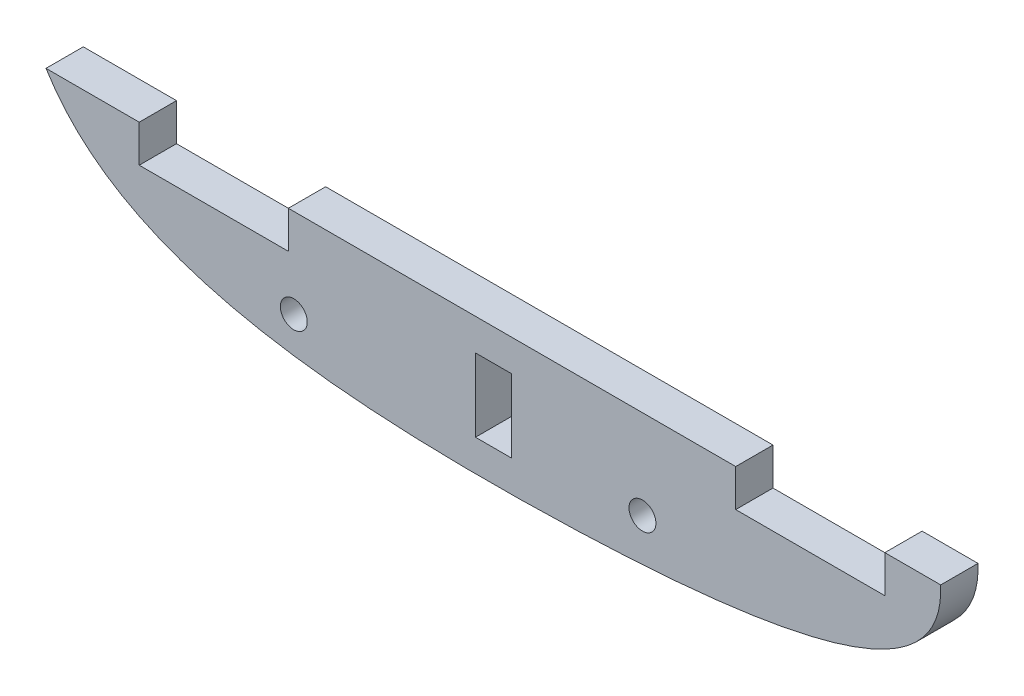
ISO-10303-21;
HEADER;
FILE_DESCRIPTION(('STEP AP214'),'2;1');
FILE_NAME('part.step','',(''),(''),'','','');
FILE_SCHEMA(('AUTOMOTIVE_DESIGN { 1 0 10303 214 1 1 1 1 }'));
ENDSEC;
DATA;
#1=APPLICATION_CONTEXT('core data for automotive mechanical design processes');
#2=APPLICATION_PROTOCOL_DEFINITION('international standard','automotive_design',2000,#1);
#3=PRODUCT_CONTEXT('',#1,'mechanical');
#4=PRODUCT('Part','Part','',(#3));
#5=PRODUCT_RELATED_PRODUCT_CATEGORY('part','',(#4));
#6=PRODUCT_DEFINITION_FORMATION('','',#4);
#7=PRODUCT_DEFINITION_CONTEXT('part definition',#1,'design');
#8=PRODUCT_DEFINITION('design','',#6,#7);
#9=PRODUCT_DEFINITION_SHAPE('','',#8);
#10=(LENGTH_UNIT() NAMED_UNIT(*) SI_UNIT(.MILLI.,.METRE.));
#11=(NAMED_UNIT(*) PLANE_ANGLE_UNIT() SI_UNIT($,.RADIAN.));
#12=(NAMED_UNIT(*) SI_UNIT($,.STERADIAN.) SOLID_ANGLE_UNIT());
#13=UNCERTAINTY_MEASURE_WITH_UNIT(LENGTH_MEASURE(1.E-05),#10,'distance_accuracy_value','');
#14=(GEOMETRIC_REPRESENTATION_CONTEXT(3) GLOBAL_UNCERTAINTY_ASSIGNED_CONTEXT((#13)) GLOBAL_UNIT_ASSIGNED_CONTEXT((#10,
#11,#12)) REPRESENTATION_CONTEXT('',''));
#15=CARTESIAN_POINT('',(0.,0.,0.));
#16=DIRECTION('',(0.,0.,1.));
#17=DIRECTION('',(1.,0.,0.));
#18=AXIS2_PLACEMENT_3D('',#15,#16,#17);
#19=CARTESIAN_POINT('',(102.303881757425,0.874047531603032,6.35));
#20=DIRECTION('',(0.,0.,-1.));
#21=DIRECTION('',(-1.,0.,0.));
#22=AXIS2_PLACEMENT_3D('',#19,#20,#21);
#23=PLANE('',#22);
#24=CARTESIAN_POINT('',(42.2078086542806,8.06779514585758,6.35));
#25=DIRECTION('',(0.,0.,1.));
#26=DIRECTION('',(1.,0.,0.));
#27=AXIS2_PLACEMENT_3D('',#24,#25,#26);
#28=CIRCLE('',#27,2.29235);
#29=CARTESIAN_POINT('',(44.5001586542806,8.06779514585758,6.35));
#30=VERTEX_POINT('',#29);
#31=EDGE_CURVE('E173',#30,#30,#28,.T.);
#32=ORIENTED_EDGE('',*,*,#31,.F.);
#33=EDGE_LOOP('',(#32));
#34=FACE_BOUND('',#33,.T.);
#35=CARTESIAN_POINT('',(101.6,8.06779514585758,6.35));
#36=DIRECTION('',(0.,0.,1.));
#37=DIRECTION('',(1.,0.,0.));
#38=AXIS2_PLACEMENT_3D('',#35,#36,#37);
#39=CIRCLE('',#38,2.29235);
#40=CARTESIAN_POINT('',(103.89235,8.06779514585758,6.35));
#41=VERTEX_POINT('',#40);
#42=EDGE_CURVE('E179',#41,#41,#39,.T.);
#43=ORIENTED_EDGE('',*,*,#42,.F.);
#44=EDGE_LOOP('',(#43));
#45=FACE_BOUND('',#44,.T.);
#46=CARTESIAN_POINT('',(0.,23.242297620253,6.35));
#47=CARTESIAN_POINT('',(9.59572841342026,7.57167225706401,6.35));
#48=CARTESIAN_POINT('',(37.6916295468297,-0.623304840125745,6.35));
#49=CARTESIAN_POINT('',(137.924513906563,0.735082948256874,6.35));
#50=CARTESIAN_POINT('',(152.821327452565,10.8513459079273,6.35));
#51=CARTESIAN_POINT('',(152.4,23.242297620253,6.35));
#52=B_SPLINE_CURVE_WITH_KNOTS('',3,(#46,#47,#48,#49,#50,#51),.UNSPECIFIED.,.F.,.F.,(4,1,1,4),
(0.,0.362368997346924,0.462368997346923,1.),.UNSPECIFIED.);
#53=CARTESIAN_POINT('',(0.,23.242297620253,6.35));
#54=VERTEX_POINT('',#53);
#55=CARTESIAN_POINT('',(152.4,23.242297620253,6.35));
#56=VERTEX_POINT('',#55);
#57=EDGE_CURVE('E184',#54,#56,#52,.T.);
#58=ORIENTED_EDGE('',*,*,#57,.T.);
#59=DIRECTION('',(-1.,0.,0.));
#60=VECTOR('',#59,1.);
#61=CARTESIAN_POINT('',(142.880645326395,23.242297620253,6.35));
#62=LINE('',#61,#60);
#63=CARTESIAN_POINT('',(142.880645326395,23.242297620253,6.35));
#64=VERTEX_POINT('',#63);
#65=EDGE_CURVE('E190',#56,#64,#62,.T.);
#66=ORIENTED_EDGE('',*,*,#65,.T.);
#67=DIRECTION('',(0.,-1.,0.));
#68=VECTOR('',#67,1.);
#69=CARTESIAN_POINT('',(142.880645326395,23.242297620253,6.35));
#70=LINE('',#69,#68);
#71=CARTESIAN_POINT('',(142.880645326395,16.892297620253,6.35));
#72=VERTEX_POINT('',#71);
#73=EDGE_CURVE('E196',#64,#72,#70,.T.);
#74=ORIENTED_EDGE('',*,*,#73,.T.);
#75=DIRECTION('',(-1.,0.,0.));
#76=VECTOR('',#75,1.);
#77=CARTESIAN_POINT('',(117.480645326395,16.892297620253,6.35));
#78=LINE('',#77,#76);
#79=CARTESIAN_POINT('',(117.480645326395,16.892297620253,6.35));
#80=VERTEX_POINT('',#79);
#81=EDGE_CURVE('E198',#72,#80,#78,.T.);
#82=ORIENTED_EDGE('',*,*,#81,.T.);
#83=DIRECTION('',(0.,1.,0.));
#84=VECTOR('',#83,1.);
#85=CARTESIAN_POINT('',(117.480645326395,23.242297620253,6.35));
#86=LINE('',#85,#84);
#87=CARTESIAN_POINT('',(117.480645326395,23.242297620253,6.35));
#88=VERTEX_POINT('',#87);
#89=EDGE_CURVE('E200',#80,#88,#86,.T.);
#90=ORIENTED_EDGE('',*,*,#89,.T.);
#91=DIRECTION('',(-1.,0.,0.));
#92=VECTOR('',#91,1.);
#93=CARTESIAN_POINT('',(41.2806453263953,23.242297620253,6.35));
#94=LINE('',#93,#92);
#95=CARTESIAN_POINT('',(41.2806453263953,23.242297620253,6.35));
#96=VERTEX_POINT('',#95);
#97=EDGE_CURVE('E202',#88,#96,#94,.T.);
#98=ORIENTED_EDGE('',*,*,#97,.T.);
#99=DIRECTION('',(0.,-1.,0.));
#100=VECTOR('',#99,1.);
#101=CARTESIAN_POINT('',(41.2806453263953,23.242297620253,6.35));
#102=LINE('',#101,#100);
#103=CARTESIAN_POINT('',(41.2806453263953,16.892297620253,6.35));
#104=VERTEX_POINT('',#103);
#105=EDGE_CURVE('E204',#96,#104,#102,.T.);
#106=ORIENTED_EDGE('',*,*,#105,.T.);
#107=DIRECTION('',(-1.,0.,0.));
#108=VECTOR('',#107,1.);
#109=CARTESIAN_POINT('',(15.8806453263953,16.892297620253,6.35));
#110=LINE('',#109,#108);
#111=CARTESIAN_POINT('',(15.8806453263953,16.892297620253,6.35));
#112=VERTEX_POINT('',#111);
#113=EDGE_CURVE('E206',#104,#112,#110,.T.);
#114=ORIENTED_EDGE('',*,*,#113,.T.);
#115=DIRECTION('',(0.,1.,0.));
#116=VECTOR('',#115,1.);
#117=CARTESIAN_POINT('',(15.8806453263953,23.242297620253,6.35));
#118=LINE('',#117,#116);
#119=CARTESIAN_POINT('',(15.8806453263953,23.242297620253,6.35));
#120=VERTEX_POINT('',#119);
#121=EDGE_CURVE('E208',#112,#120,#118,.T.);
#122=ORIENTED_EDGE('',*,*,#121,.T.);
#123=DIRECTION('',(-1.,0.,0.));
#124=VECTOR('',#123,1.);
#125=CARTESIAN_POINT('',(0.,23.242297620253,6.35));
#126=LINE('',#125,#124);
#127=EDGE_CURVE('E210',#120,#54,#126,.T.);
#128=ORIENTED_EDGE('',*,*,#127,.T.);
#129=EDGE_LOOP('',(#58,#66,#74,#82,#90,#98,#106,#114,#122,#128));
#130=FACE_BOUND('',#129,.T.);
#131=DIRECTION('',(0.,1.,0.));
#132=VECTOR('',#131,1.);
#133=CARTESIAN_POINT('',(79.248,5.39814881012649,6.35));
#134=LINE('',#133,#132);
#135=CARTESIAN_POINT('',(79.248,5.39814881012649,6.35));
#136=VERTEX_POINT('',#135);
#137=CARTESIAN_POINT('',(79.248,17.8441488101265,6.35));
#138=VERTEX_POINT('',#137);
#139=EDGE_CURVE('E137',#136,#138,#134,.T.);
#140=ORIENTED_EDGE('',*,*,#139,.F.);
#141=DIRECTION('',(1.,0.,0.));
#142=VECTOR('',#141,1.);
#143=CARTESIAN_POINT('',(73.152,5.39814881012649,6.35));
#144=LINE('',#143,#142);
#145=CARTESIAN_POINT('',(73.152,5.39814881012649,6.35));
#146=VERTEX_POINT('',#145);
#147=EDGE_CURVE('E159',#146,#136,#144,.T.);
#148=ORIENTED_EDGE('',*,*,#147,.F.);
#149=DIRECTION('',(0.,-1.,0.));
#150=VECTOR('',#149,1.);
#151=CARTESIAN_POINT('',(73.152,5.39814881012649,6.35));
#152=LINE('',#151,#150);
#153=CARTESIAN_POINT('',(73.152,17.8441488101265,6.35));
#154=VERTEX_POINT('',#153);
#155=EDGE_CURVE('E157',#154,#146,#152,.T.);
#156=ORIENTED_EDGE('',*,*,#155,.F.);
#157=DIRECTION('',(-1.,0.,0.));
#158=VECTOR('',#157,1.);
#159=CARTESIAN_POINT('',(73.152,17.8441488101265,6.35));
#160=LINE('',#159,#158);
#161=EDGE_CURVE('E145',#138,#154,#160,.T.);
#162=ORIENTED_EDGE('',*,*,#161,.F.);
#163=EDGE_LOOP('',(#140,#148,#156,#162));
#164=FACE_BOUND('',#163,.T.);
#165=ADVANCED_FACE('F35',(#34,#45,#130,#164),#23,.F.);
#166=CARTESIAN_POINT('',(102.303881757425,0.874047531603032,0.));
#167=DIRECTION('',(0.,0.,-1.));
#168=DIRECTION('',(-1.,0.,0.));
#169=AXIS2_PLACEMENT_3D('',#166,#167,#168);
#170=PLANE('',#169);
#171=CARTESIAN_POINT('',(101.6,8.06779514585758,0.));
#172=DIRECTION('',(0.,0.,1.));
#173=DIRECTION('',(1.,0.,0.));
#174=AXIS2_PLACEMENT_3D('',#171,#172,#173);
#175=CIRCLE('',#174,2.29235);
#176=CARTESIAN_POINT('',(103.89235,8.06779514585758,0.));
#177=VERTEX_POINT('',#176);
#178=EDGE_CURVE('E176',#177,#177,#175,.T.);
#179=ORIENTED_EDGE('',*,*,#178,.T.);
#180=EDGE_LOOP('',(#179));
#181=FACE_BOUND('',#180,.T.);
#182=CARTESIAN_POINT('',(0.,23.242297620253,0.));
#183=CARTESIAN_POINT('',(9.59572841342026,7.57167225706401,0.));
#184=CARTESIAN_POINT('',(37.6916295468297,-0.623304840125745,0.));
#185=CARTESIAN_POINT('',(137.924513906563,0.735082948256874,0.));
#186=CARTESIAN_POINT('',(152.821327452565,10.8513459079273,0.));
#187=CARTESIAN_POINT('',(152.4,23.242297620253,0.));
#188=B_SPLINE_CURVE_WITH_KNOTS('',3,(#182,#183,#184,#185,#186,#187),.UNSPECIFIED.,.F.,.F.,(4,1,
1,4),(0.,0.362368997346924,0.462368997346923,1.),.UNSPECIFIED.);
#189=CARTESIAN_POINT('',(0.,23.242297620253,0.));
#190=VERTEX_POINT('',#189);
#191=CARTESIAN_POINT('',(152.4,23.242297620253,0.));
#192=VERTEX_POINT('',#191);
#193=EDGE_CURVE('E182',#190,#192,#188,.T.);
#194=ORIENTED_EDGE('',*,*,#193,.F.);
#195=DIRECTION('',(-1.,0.,0.));
#196=VECTOR('',#195,1.);
#197=CARTESIAN_POINT('',(0.,23.242297620253,0.));
#198=LINE('',#197,#196);
#199=CARTESIAN_POINT('',(15.8806453263953,23.242297620253,0.));
#200=VERTEX_POINT('',#199);
#201=EDGE_CURVE('E191',#200,#190,#198,.T.);
#202=ORIENTED_EDGE('',*,*,#201,.F.);
#203=DIRECTION('',(0.,1.,0.));
#204=VECTOR('',#203,1.);
#205=CARTESIAN_POINT('',(15.8806453263953,23.242297620253,0.));
#206=LINE('',#205,#204);
#207=CARTESIAN_POINT('',(15.8806453263953,16.892297620253,0.));
#208=VERTEX_POINT('',#207);
#209=EDGE_CURVE('E234',#208,#200,#206,.T.);
#210=ORIENTED_EDGE('',*,*,#209,.F.);
#211=DIRECTION('',(-1.,0.,0.));
#212=VECTOR('',#211,1.);
#213=CARTESIAN_POINT('',(15.8806453263953,16.892297620253,0.));
#214=LINE('',#213,#212);
#215=CARTESIAN_POINT('',(41.2806453263953,16.892297620253,0.));
#216=VERTEX_POINT('',#215);
#217=EDGE_CURVE('E232',#216,#208,#214,.T.);
#218=ORIENTED_EDGE('',*,*,#217,.F.);
#219=DIRECTION('',(0.,-1.,0.));
#220=VECTOR('',#219,1.);
#221=CARTESIAN_POINT('',(41.2806453263953,23.242297620253,0.));
#222=LINE('',#221,#220);
#223=CARTESIAN_POINT('',(41.2806453263953,23.242297620253,0.));
#224=VERTEX_POINT('',#223);
#225=EDGE_CURVE('E230',#224,#216,#222,.T.);
#226=ORIENTED_EDGE('',*,*,#225,.F.);
#227=DIRECTION('',(-1.,0.,0.));
#228=VECTOR('',#227,1.);
#229=CARTESIAN_POINT('',(41.2806453263953,23.242297620253,0.));
#230=LINE('',#229,#228);
#231=CARTESIAN_POINT('',(117.480645326395,23.242297620253,0.));
#232=VERTEX_POINT('',#231);
#233=EDGE_CURVE('E228',#232,#224,#230,.T.);
#234=ORIENTED_EDGE('',*,*,#233,.F.);
#235=DIRECTION('',(0.,1.,0.));
#236=VECTOR('',#235,1.);
#237=CARTESIAN_POINT('',(117.480645326395,23.242297620253,0.));
#238=LINE('',#237,#236);
#239=CARTESIAN_POINT('',(117.480645326395,16.892297620253,0.));
#240=VERTEX_POINT('',#239);
#241=EDGE_CURVE('E226',#240,#232,#238,.T.);
#242=ORIENTED_EDGE('',*,*,#241,.F.);
#243=DIRECTION('',(-1.,0.,0.));
#244=VECTOR('',#243,1.);
#245=CARTESIAN_POINT('',(117.480645326395,16.892297620253,0.));
#246=LINE('',#245,#244);
#247=CARTESIAN_POINT('',(142.880645326395,16.892297620253,0.));
#248=VERTEX_POINT('',#247);
#249=EDGE_CURVE('E224',#248,#240,#246,.T.);
#250=ORIENTED_EDGE('',*,*,#249,.F.);
#251=DIRECTION('',(0.,-1.,0.));
#252=VECTOR('',#251,1.);
#253=CARTESIAN_POINT('',(142.880645326395,23.242297620253,0.));
#254=LINE('',#253,#252);
#255=CARTESIAN_POINT('',(142.880645326395,23.242297620253,0.));
#256=VERTEX_POINT('',#255);
#257=EDGE_CURVE('E222',#256,#248,#254,.T.);
#258=ORIENTED_EDGE('',*,*,#257,.F.);
#259=DIRECTION('',(-1.,0.,0.));
#260=VECTOR('',#259,1.);
#261=CARTESIAN_POINT('',(142.880645326395,23.242297620253,0.));
#262=LINE('',#261,#260);
#263=EDGE_CURVE('E217',#192,#256,#262,.T.);
#264=ORIENTED_EDGE('',*,*,#263,.F.);
#265=EDGE_LOOP('',(#194,#202,#210,#218,#226,#234,#242,#250,#258,#264));
#266=FACE_BOUND('',#265,.T.);
#267=CARTESIAN_POINT('',(42.2078086542806,8.06779514585758,0.));
#268=DIRECTION('',(0.,0.,1.));
#269=DIRECTION('',(1.,0.,0.));
#270=AXIS2_PLACEMENT_3D('',#267,#268,#269);
#271=CIRCLE('',#270,2.29235);
#272=CARTESIAN_POINT('',(44.5001586542806,8.06779514585758,0.));
#273=VERTEX_POINT('',#272);
#274=EDGE_CURVE('E153',#273,#273,#271,.T.);
#275=ORIENTED_EDGE('',*,*,#274,.T.);
#276=EDGE_LOOP('',(#275));
#277=FACE_BOUND('',#276,.T.);
#278=DIRECTION('',(1.,0.,0.));
#279=VECTOR('',#278,1.);
#280=CARTESIAN_POINT('',(73.152,5.39814881012649,0.));
#281=LINE('',#280,#279);
#282=CARTESIAN_POINT('',(73.152,5.39814881012649,0.));
#283=VERTEX_POINT('',#282);
#284=CARTESIAN_POINT('',(79.248,5.39814881012649,0.));
#285=VERTEX_POINT('',#284);
#286=EDGE_CURVE('E146',#283,#285,#281,.T.);
#287=ORIENTED_EDGE('',*,*,#286,.T.);
#288=DIRECTION('',(0.,1.,0.));
#289=VECTOR('',#288,1.);
#290=CARTESIAN_POINT('',(79.248,5.39814881012649,0.));
#291=LINE('',#290,#289);
#292=CARTESIAN_POINT('',(79.248,17.8441488101265,0.));
#293=VERTEX_POINT('',#292);
#294=EDGE_CURVE('E59',#285,#293,#291,.T.);
#295=ORIENTED_EDGE('',*,*,#294,.T.);
#296=DIRECTION('',(-1.,0.,0.));
#297=VECTOR('',#296,1.);
#298=CARTESIAN_POINT('',(73.152,17.8441488101265,0.));
#299=LINE('',#298,#297);
#300=CARTESIAN_POINT('',(73.152,17.8441488101265,0.));
#301=VERTEX_POINT('',#300);
#302=EDGE_CURVE('E152',#293,#301,#299,.T.);
#303=ORIENTED_EDGE('',*,*,#302,.T.);
#304=DIRECTION('',(0.,-1.,0.));
#305=VECTOR('',#304,1.);
#306=CARTESIAN_POINT('',(73.152,5.39814881012649,0.));
#307=LINE('',#306,#305);
#308=EDGE_CURVE('E165',#301,#283,#307,.T.);
#309=ORIENTED_EDGE('',*,*,#308,.T.);
#310=EDGE_LOOP('',(#287,#295,#303,#309));
#311=FACE_BOUND('',#310,.T.);
#312=ADVANCED_FACE('F270',(#181,#266,#277,#311),#170,.T.);
#313=DIRECTION('',(0.,0.,-1.));
#314=VECTOR('',#313,1.);
#315=SURFACE_OF_LINEAR_EXTRUSION('',#52,#314);
#316=ORIENTED_EDGE('',*,*,#193,.T.);
#317=DIRECTION('',(0.,0.,-1.));
#318=VECTOR('',#317,1.);
#319=CARTESIAN_POINT('',(152.4,23.242297620253,6.35));
#320=LINE('',#319,#318);
#321=EDGE_CURVE('E11',#56,#192,#320,.T.);
#322=ORIENTED_EDGE('',*,*,#321,.F.);
#323=ORIENTED_EDGE('',*,*,#57,.F.);
#324=DIRECTION('',(0.,0.,-1.));
#325=VECTOR('',#324,1.);
#326=CARTESIAN_POINT('',(0.,23.242297620253,6.35));
#327=LINE('',#326,#325);
#328=EDGE_CURVE('E212',#54,#190,#327,.T.);
#329=ORIENTED_EDGE('',*,*,#328,.T.);
#330=EDGE_LOOP('',(#316,#322,#323,#329));
#331=FACE_BOUND('',#330,.T.);
#332=ADVANCED_FACE('F37',(#331),#315,.F.);
#333=CARTESIAN_POINT('',(142.880645326395,23.242297620253,6.35));
#334=DIRECTION('',(0.,-1.,0.));
#335=DIRECTION('',(0.,0.,-1.));
#336=AXIS2_PLACEMENT_3D('',#333,#334,#335);
#337=PLANE('',#336);
#338=ORIENTED_EDGE('',*,*,#263,.T.);
#339=DIRECTION('',(0.,0.,-1.));
#340=VECTOR('',#339,1.);
#341=CARTESIAN_POINT('',(142.880645326395,23.242297620253,6.35));
#342=LINE('',#341,#340);
#343=EDGE_CURVE('E44',#64,#256,#342,.T.);
#344=ORIENTED_EDGE('',*,*,#343,.F.);
#345=ORIENTED_EDGE('',*,*,#65,.F.);
#346=ORIENTED_EDGE('',*,*,#321,.T.);
#347=EDGE_LOOP('',(#338,#344,#345,#346));
#348=FACE_BOUND('',#347,.T.);
#349=ADVANCED_FACE('F287',(#348),#337,.F.);
#350=CARTESIAN_POINT('',(142.880645326395,23.242297620253,6.35));
#351=DIRECTION('',(1.,0.,0.));
#352=DIRECTION('',(0.,0.,-1.));
#353=AXIS2_PLACEMENT_3D('',#350,#351,#352);
#354=PLANE('',#353);
#355=ORIENTED_EDGE('',*,*,#257,.T.);
#356=DIRECTION('',(0.,0.,-1.));
#357=VECTOR('',#356,1.);
#358=CARTESIAN_POINT('',(142.880645326395,16.892297620253,6.35));
#359=LINE('',#358,#357);
#360=EDGE_CURVE('E257',#72,#248,#359,.T.);
#361=ORIENTED_EDGE('',*,*,#360,.F.);
#362=ORIENTED_EDGE('',*,*,#73,.F.);
#363=ORIENTED_EDGE('',*,*,#343,.T.);
#364=EDGE_LOOP('',(#355,#361,#362,#363));
#365=FACE_BOUND('',#364,.T.);
#366=ADVANCED_FACE('F264',(#365),#354,.F.);
#367=CARTESIAN_POINT('',(117.480645326395,16.892297620253,6.35));
#368=DIRECTION('',(0.,-1.,0.));
#369=DIRECTION('',(0.,0.,-1.));
#370=AXIS2_PLACEMENT_3D('',#367,#368,#369);
#371=PLANE('',#370);
#372=ORIENTED_EDGE('',*,*,#249,.T.);
#373=DIRECTION('',(0.,0.,-1.));
#374=VECTOR('',#373,1.);
#375=CARTESIAN_POINT('',(117.480645326395,16.892297620253,6.35));
#376=LINE('',#375,#374);
#377=EDGE_CURVE('E254',#80,#240,#376,.T.);
#378=ORIENTED_EDGE('',*,*,#377,.F.);
#379=ORIENTED_EDGE('',*,*,#81,.F.);
#380=ORIENTED_EDGE('',*,*,#360,.T.);
#381=EDGE_LOOP('',(#372,#378,#379,#380));
#382=FACE_BOUND('',#381,.T.);
#383=ADVANCED_FACE('F276',(#382),#371,.F.);
#384=CARTESIAN_POINT('',(117.480645326395,23.242297620253,6.35));
#385=DIRECTION('',(-1.,0.,0.));
#386=DIRECTION('',(0.,0.,1.));
#387=AXIS2_PLACEMENT_3D('',#384,#385,#386);
#388=PLANE('',#387);
#389=ORIENTED_EDGE('',*,*,#241,.T.);
#390=DIRECTION('',(0.,0.,-1.));
#391=VECTOR('',#390,1.);
#392=CARTESIAN_POINT('',(117.480645326395,23.242297620253,6.35));
#393=LINE('',#392,#391);
#394=EDGE_CURVE('E251',#88,#232,#393,.T.);
#395=ORIENTED_EDGE('',*,*,#394,.F.);
#396=ORIENTED_EDGE('',*,*,#89,.F.);
#397=ORIENTED_EDGE('',*,*,#377,.T.);
#398=EDGE_LOOP('',(#389,#395,#396,#397));
#399=FACE_BOUND('',#398,.T.);
#400=ADVANCED_FACE('F280',(#399),#388,.F.);
#401=CARTESIAN_POINT('',(41.2806453263953,23.242297620253,6.35));
#402=DIRECTION('',(0.,-1.,0.));
#403=DIRECTION('',(0.,0.,-1.));
#404=AXIS2_PLACEMENT_3D('',#401,#402,#403);
#405=PLANE('',#404);
#406=ORIENTED_EDGE('',*,*,#233,.T.);
#407=DIRECTION('',(0.,0.,-1.));
#408=VECTOR('',#407,1.);
#409=CARTESIAN_POINT('',(41.2806453263953,23.242297620253,6.35));
#410=LINE('',#409,#408);
#411=EDGE_CURVE('E248',#96,#224,#410,.T.);
#412=ORIENTED_EDGE('',*,*,#411,.F.);
#413=ORIENTED_EDGE('',*,*,#97,.F.);
#414=ORIENTED_EDGE('',*,*,#394,.T.);
#415=EDGE_LOOP('',(#406,#412,#413,#414));
#416=FACE_BOUND('',#415,.T.);
#417=ADVANCED_FACE('F310',(#416),#405,.F.);
#418=CARTESIAN_POINT('',(41.2806453263953,23.242297620253,6.35));
#419=DIRECTION('',(1.,0.,0.));
#420=DIRECTION('',(0.,0.,-1.));
#421=AXIS2_PLACEMENT_3D('',#418,#419,#420);
#422=PLANE('',#421);
#423=ORIENTED_EDGE('',*,*,#225,.T.);
#424=DIRECTION('',(0.,0.,-1.));
#425=VECTOR('',#424,1.);
#426=CARTESIAN_POINT('',(41.2806453263953,16.892297620253,6.35));
#427=LINE('',#426,#425);
#428=EDGE_CURVE('E245',#104,#216,#427,.T.);
#429=ORIENTED_EDGE('',*,*,#428,.F.);
#430=ORIENTED_EDGE('',*,*,#105,.F.);
#431=ORIENTED_EDGE('',*,*,#411,.T.);
#432=EDGE_LOOP('',(#423,#429,#430,#431));
#433=FACE_BOUND('',#432,.T.);
#434=ADVANCED_FACE('F307',(#433),#422,.F.);
#435=CARTESIAN_POINT('',(15.8806453263953,16.892297620253,6.35));
#436=DIRECTION('',(0.,-1.,0.));
#437=DIRECTION('',(0.,0.,-1.));
#438=AXIS2_PLACEMENT_3D('',#435,#436,#437);
#439=PLANE('',#438);
#440=ORIENTED_EDGE('',*,*,#217,.T.);
#441=DIRECTION('',(0.,0.,-1.));
#442=VECTOR('',#441,1.);
#443=CARTESIAN_POINT('',(15.8806453263953,16.892297620253,6.35));
#444=LINE('',#443,#442);
#445=EDGE_CURVE('E242',#112,#208,#444,.T.);
#446=ORIENTED_EDGE('',*,*,#445,.F.);
#447=ORIENTED_EDGE('',*,*,#113,.F.);
#448=ORIENTED_EDGE('',*,*,#428,.T.);
#449=EDGE_LOOP('',(#440,#446,#447,#448));
#450=FACE_BOUND('',#449,.T.);
#451=ADVANCED_FACE('F303',(#450),#439,.F.);
#452=CARTESIAN_POINT('',(15.8806453263953,23.242297620253,6.35));
#453=DIRECTION('',(-1.,0.,0.));
#454=DIRECTION('',(0.,-1.,0.));
#455=AXIS2_PLACEMENT_3D('',#452,#453,#454);
#456=PLANE('',#455);
#457=ORIENTED_EDGE('',*,*,#209,.T.);
#458=DIRECTION('',(0.,0.,-1.));
#459=VECTOR('',#458,1.);
#460=CARTESIAN_POINT('',(15.8806453263953,23.242297620253,6.35));
#461=LINE('',#460,#459);
#462=EDGE_CURVE('E239',#120,#200,#461,.T.);
#463=ORIENTED_EDGE('',*,*,#462,.F.);
#464=ORIENTED_EDGE('',*,*,#121,.F.);
#465=ORIENTED_EDGE('',*,*,#445,.T.);
#466=EDGE_LOOP('',(#457,#463,#464,#465));
#467=FACE_BOUND('',#466,.T.);
#468=ADVANCED_FACE('F299',(#467),#456,.F.);
#469=CARTESIAN_POINT('',(0.,23.242297620253,6.35));
#470=DIRECTION('',(0.,-1.,0.));
#471=DIRECTION('',(0.,0.,-1.));
#472=AXIS2_PLACEMENT_3D('',#469,#470,#471);
#473=PLANE('',#472);
#474=ORIENTED_EDGE('',*,*,#201,.T.);
#475=ORIENTED_EDGE('',*,*,#328,.F.);
#476=ORIENTED_EDGE('',*,*,#127,.F.);
#477=ORIENTED_EDGE('',*,*,#462,.T.);
#478=EDGE_LOOP('',(#474,#475,#476,#477));
#479=FACE_BOUND('',#478,.T.);
#480=ADVANCED_FACE('F294',(#479),#473,.F.);
#481=CARTESIAN_POINT('',(101.6,8.06779514585758,6.35));
#482=DIRECTION('',(0.,0.,-1.));
#483=DIRECTION('',(-1.,0.,0.));
#484=AXIS2_PLACEMENT_3D('',#481,#482,#483);
#485=CYLINDRICAL_SURFACE('',#484,2.29235);
#486=ORIENTED_EDGE('',*,*,#42,.T.);
#487=EDGE_LOOP('',(#486));
#488=FACE_BOUND('',#487,.T.);
#489=ORIENTED_EDGE('',*,*,#178,.F.);
#490=EDGE_LOOP('',(#489));
#491=FACE_BOUND('',#490,.T.);
#492=ADVANCED_FACE('F330',(#488,#491),#485,.F.);
#493=CARTESIAN_POINT('',(42.2078086542806,8.06779514585758,6.35));
#494=DIRECTION('',(0.,0.,-1.));
#495=DIRECTION('',(-1.,0.,0.));
#496=AXIS2_PLACEMENT_3D('',#493,#494,#495);
#497=CYLINDRICAL_SURFACE('',#496,2.29235);
#498=ORIENTED_EDGE('',*,*,#31,.T.);
#499=EDGE_LOOP('',(#498));
#500=FACE_BOUND('',#499,.T.);
#501=ORIENTED_EDGE('',*,*,#274,.F.);
#502=EDGE_LOOP('',(#501));
#503=FACE_BOUND('',#502,.T.);
#504=ADVANCED_FACE('F356',(#500,#503),#497,.F.);
#505=CARTESIAN_POINT('',(79.248,5.39814881012649,6.35));
#506=DIRECTION('',(-1.,0.,0.));
#507=DIRECTION('',(0.,0.,1.));
#508=AXIS2_PLACEMENT_3D('',#505,#506,#507);
#509=PLANE('',#508);
#510=ORIENTED_EDGE('',*,*,#294,.F.);
#511=DIRECTION('',(0.,0.,-1.));
#512=VECTOR('',#511,1.);
#513=CARTESIAN_POINT('',(79.248,5.39814881012649,6.35));
#514=LINE('',#513,#512);
#515=EDGE_CURVE('E141',#136,#285,#514,.T.);
#516=ORIENTED_EDGE('',*,*,#515,.F.);
#517=ORIENTED_EDGE('',*,*,#139,.T.);
#518=DIRECTION('',(0.,0.,-1.));
#519=VECTOR('',#518,1.);
#520=CARTESIAN_POINT('',(79.248,17.8441488101265,6.35));
#521=LINE('',#520,#519);
#522=EDGE_CURVE('E140',#138,#293,#521,.T.);
#523=ORIENTED_EDGE('',*,*,#522,.T.);
#524=EDGE_LOOP('',(#510,#516,#517,#523));
#525=FACE_BOUND('',#524,.T.);
#526=ADVANCED_FACE('F139',(#525),#509,.T.);
#527=CARTESIAN_POINT('',(73.152,17.8441488101265,6.35));
#528=DIRECTION('',(0.,-1.,0.));
#529=DIRECTION('',(0.,0.,-1.));
#530=AXIS2_PLACEMENT_3D('',#527,#528,#529);
#531=PLANE('',#530);
#532=ORIENTED_EDGE('',*,*,#302,.F.);
#533=ORIENTED_EDGE('',*,*,#522,.F.);
#534=ORIENTED_EDGE('',*,*,#161,.T.);
#535=DIRECTION('',(0.,0.,-1.));
#536=VECTOR('',#535,1.);
#537=CARTESIAN_POINT('',(73.152,17.8441488101265,6.35));
#538=LINE('',#537,#536);
#539=EDGE_CURVE('E154',#154,#301,#538,.T.);
#540=ORIENTED_EDGE('',*,*,#539,.T.);
#541=EDGE_LOOP('',(#532,#533,#534,#540));
#542=FACE_BOUND('',#541,.T.);
#543=ADVANCED_FACE('F149',(#542),#531,.T.);
#544=CARTESIAN_POINT('',(73.152,5.39814881012649,6.35));
#545=DIRECTION('',(1.,0.,0.));
#546=DIRECTION('',(0.,0.,-1.));
#547=AXIS2_PLACEMENT_3D('',#544,#545,#546);
#548=PLANE('',#547);
#549=ORIENTED_EDGE('',*,*,#308,.F.);
#550=ORIENTED_EDGE('',*,*,#539,.F.);
#551=ORIENTED_EDGE('',*,*,#155,.T.);
#552=DIRECTION('',(0.,0.,-1.));
#553=VECTOR('',#552,1.);
#554=CARTESIAN_POINT('',(73.152,5.39814881012649,6.35));
#555=LINE('',#554,#553);
#556=EDGE_CURVE('E51',#146,#283,#555,.T.);
#557=ORIENTED_EDGE('',*,*,#556,.T.);
#558=EDGE_LOOP('',(#549,#550,#551,#557));
#559=FACE_BOUND('',#558,.T.);
#560=ADVANCED_FACE('F375',(#559),#548,.T.);
#561=CARTESIAN_POINT('',(73.152,5.39814881012649,6.35));
#562=DIRECTION('',(0.,1.,0.));
#563=DIRECTION('',(0.,0.,1.));
#564=AXIS2_PLACEMENT_3D('',#561,#562,#563);
#565=PLANE('',#564);
#566=ORIENTED_EDGE('',*,*,#286,.F.);
#567=ORIENTED_EDGE('',*,*,#556,.F.);
#568=ORIENTED_EDGE('',*,*,#147,.T.);
#569=ORIENTED_EDGE('',*,*,#515,.T.);
#570=EDGE_LOOP('',(#566,#567,#568,#569));
#571=FACE_BOUND('',#570,.T.);
#572=ADVANCED_FACE('F382',(#571),#565,.T.);
#573=CLOSED_SHELL('',(#165,#312,#332,#349,#366,#383,#400,#417,#434,#451,#468,#480,#492,#504,
#526,#543,#560,#572));
#574=MANIFOLD_SOLID_BREP('B2',#573);
#575=ADVANCED_BREP_SHAPE_REPRESENTATION('',(#18,#574),#14);
#576=SHAPE_DEFINITION_REPRESENTATION(#9,#575);
ENDSEC;
END-ISO-10303-21;
